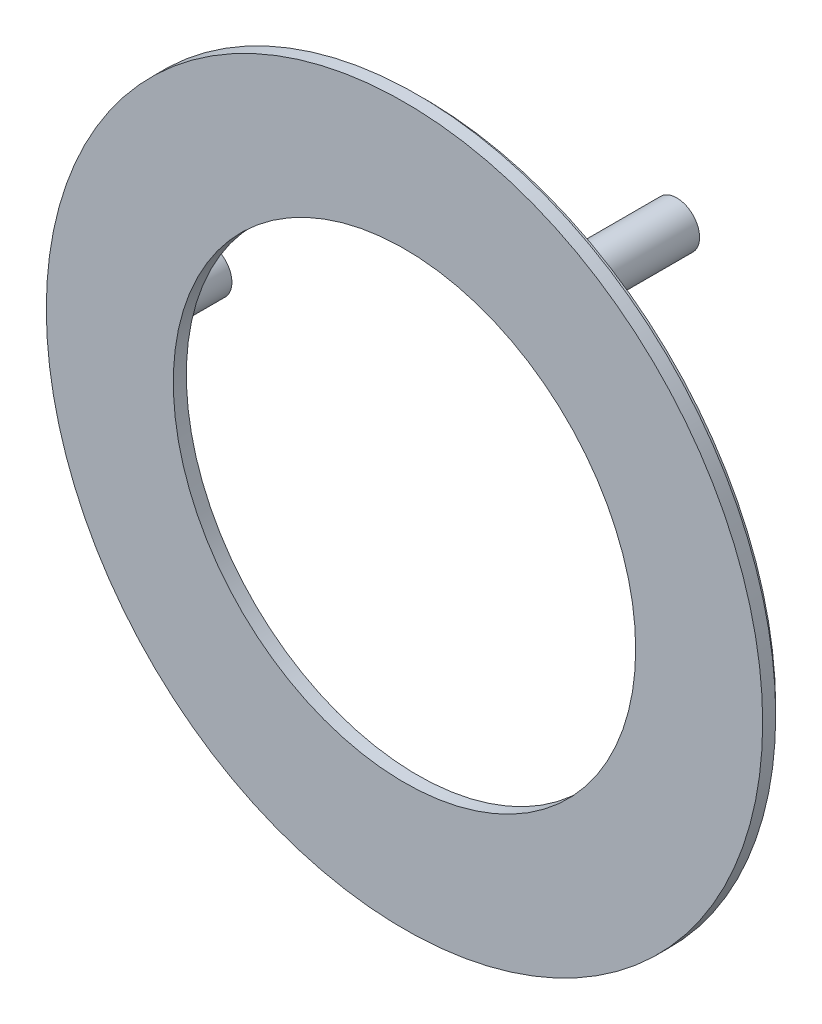
ISO-10303-21;
HEADER;
FILE_DESCRIPTION(('STEP AP214'),'2;1');
FILE_NAME('part.step','',(''),(''),'','','');
FILE_SCHEMA(('AUTOMOTIVE_DESIGN { 1 0 10303 214 1 1 1 1 }'));
ENDSEC;
DATA;
#1=APPLICATION_CONTEXT('core data for automotive mechanical design processes');
#2=APPLICATION_PROTOCOL_DEFINITION('international standard','automotive_design',2000,#1);
#3=PRODUCT_CONTEXT('',#1,'mechanical');
#4=PRODUCT('Part','Part','',(#3));
#5=PRODUCT_RELATED_PRODUCT_CATEGORY('part','',(#4));
#6=PRODUCT_DEFINITION_FORMATION('','',#4);
#7=PRODUCT_DEFINITION_CONTEXT('part definition',#1,'design');
#8=PRODUCT_DEFINITION('design','',#6,#7);
#9=PRODUCT_DEFINITION_SHAPE('','',#8);
#10=(LENGTH_UNIT() NAMED_UNIT(*) SI_UNIT(.MILLI.,.METRE.));
#11=(NAMED_UNIT(*) PLANE_ANGLE_UNIT() SI_UNIT($,.RADIAN.));
#12=(NAMED_UNIT(*) SI_UNIT($,.STERADIAN.) SOLID_ANGLE_UNIT());
#13=UNCERTAINTY_MEASURE_WITH_UNIT(LENGTH_MEASURE(1.E-05),#10,'distance_accuracy_value','');
#14=(GEOMETRIC_REPRESENTATION_CONTEXT(3) GLOBAL_UNCERTAINTY_ASSIGNED_CONTEXT((#13)) GLOBAL_UNIT_ASSIGNED_CONTEXT((#10,
#11,#12)) REPRESENTATION_CONTEXT('',''));
#15=CARTESIAN_POINT('',(0.,0.,0.));
#16=DIRECTION('',(0.,0.,1.));
#17=DIRECTION('',(1.,0.,0.));
#18=AXIS2_PLACEMENT_3D('',#15,#16,#17);
#19=CARTESIAN_POINT('',(0.,0.,49.));
#20=DIRECTION('',(0.,0.,1.));
#21=DIRECTION('',(1.,0.,0.));
#22=AXIS2_PLACEMENT_3D('',#19,#20,#21);
#23=CYLINDRICAL_SURFACE('',#22,54.);
#24=CARTESIAN_POINT('',(0.,0.,49.));
#25=DIRECTION('',(0.,0.,1.));
#26=DIRECTION('',(1.,0.,0.));
#27=AXIS2_PLACEMENT_3D('',#24,#25,#26);
#28=CIRCLE('',#27,54.);
#29=CARTESIAN_POINT('',(54.,0.,49.));
#30=VERTEX_POINT('',#29);
#31=EDGE_CURVE('E53',#30,#30,#28,.T.);
#32=ORIENTED_EDGE('',*,*,#31,.T.);
#33=EDGE_LOOP('',(#32));
#34=FACE_BOUND('',#33,.T.);
#35=CARTESIAN_POINT('',(0.,0.,50.));
#36=DIRECTION('',(0.,0.,1.));
#37=DIRECTION('',(1.,0.,0.));
#38=AXIS2_PLACEMENT_3D('',#35,#36,#37);
#39=CIRCLE('',#38,54.);
#40=CARTESIAN_POINT('',(54.,0.,50.));
#41=VERTEX_POINT('',#40);
#42=EDGE_CURVE('E56',#41,#41,#39,.T.);
#43=ORIENTED_EDGE('',*,*,#42,.F.);
#44=EDGE_LOOP('',(#43));
#45=FACE_BOUND('',#44,.T.);
#46=ADVANCED_FACE('F39',(#34,#45),#23,.T.);
#47=CARTESIAN_POINT('',(0.,0.,49.));
#48=DIRECTION('',(0.,0.,1.));
#49=DIRECTION('',(1.,0.,0.));
#50=AXIS2_PLACEMENT_3D('',#47,#48,#49);
#51=PLANE('',#50);
#52=CARTESIAN_POINT('',(0.,0.,49.));
#53=DIRECTION('',(0.,0.,1.));
#54=DIRECTION('',(1.,0.,0.));
#55=AXIS2_PLACEMENT_3D('',#52,#53,#54);
#56=CIRCLE('',#55,52.);
#57=CARTESIAN_POINT('',(52.,0.,49.));
#58=VERTEX_POINT('',#57);
#59=EDGE_CURVE('E59',#58,#58,#56,.T.);
#60=ORIENTED_EDGE('',*,*,#59,.T.);
#61=EDGE_LOOP('',(#60));
#62=FACE_BOUND('',#61,.T.);
#63=ORIENTED_EDGE('',*,*,#31,.F.);
#64=EDGE_LOOP('',(#63));
#65=FACE_BOUND('',#64,.T.);
#66=ADVANCED_FACE('F135',(#62,#65),#51,.F.);
#67=CARTESIAN_POINT('',(0.,0.,49.));
#68=DIRECTION('',(0.,0.,1.));
#69=DIRECTION('',(1.,0.,0.));
#70=AXIS2_PLACEMENT_3D('',#67,#68,#69);
#71=CYLINDRICAL_SURFACE('',#70,52.);
#72=ORIENTED_EDGE('',*,*,#59,.F.);
#73=EDGE_LOOP('',(#72));
#74=FACE_BOUND('',#73,.T.);
#75=CARTESIAN_POINT('',(0.,0.,50.));
#76=DIRECTION('',(0.,0.,1.));
#77=DIRECTION('',(1.,0.,0.));
#78=AXIS2_PLACEMENT_3D('',#75,#76,#77);
#79=CIRCLE('',#78,52.);
#80=CARTESIAN_POINT('',(52.,0.,50.));
#81=VERTEX_POINT('',#80);
#82=EDGE_CURVE('E62',#81,#81,#79,.T.);
#83=ORIENTED_EDGE('',*,*,#82,.T.);
#84=EDGE_LOOP('',(#83));
#85=FACE_BOUND('',#84,.T.);
#86=ADVANCED_FACE('F122',(#74,#85),#71,.F.);
#87=CARTESIAN_POINT('',(0.,0.,50.));
#88=DIRECTION('',(0.,0.,1.));
#89=DIRECTION('',(1.,0.,0.));
#90=AXIS2_PLACEMENT_3D('',#87,#88,#89);
#91=PLANE('',#90);
#92=CARTESIAN_POINT('',(24.1858412210151,-41.4613685788572,50.));
#93=DIRECTION('',(0.,0.,1.));
#94=DIRECTION('',(1.,0.,0.));
#95=AXIS2_PLACEMENT_3D('',#92,#93,#94);
#96=CIRCLE('',#95,3.5);
#97=CARTESIAN_POINT('',(27.6858412210151,-41.4613685788572,50.));
#98=VERTEX_POINT('',#97);
#99=EDGE_CURVE('E101',#98,#98,#96,.T.);
#100=ORIENTED_EDGE('',*,*,#99,.T.);
#101=EDGE_LOOP('',(#100));
#102=FACE_BOUND('',#101,.T.);
#103=CARTESIAN_POINT('',(23.8136778544525,41.6762371987246,50.));
#104=DIRECTION('',(0.,0.,1.));
#105=DIRECTION('',(1.,0.,0.));
#106=AXIS2_PLACEMENT_3D('',#103,#104,#105);
#107=CIRCLE('',#106,3.5);
#108=CARTESIAN_POINT('',(27.3136778544525,41.6762371987246,50.));
#109=VERTEX_POINT('',#108);
#110=EDGE_CURVE('E92',#109,#109,#107,.T.);
#111=ORIENTED_EDGE('',*,*,#110,.T.);
#112=EDGE_LOOP('',(#111));
#113=FACE_BOUND('',#112,.T.);
#114=CARTESIAN_POINT('',(-47.9995190754678,-0.214868619867746,50.));
#115=DIRECTION('',(0.,0.,1.));
#116=DIRECTION('',(1.,0.,0.));
#117=AXIS2_PLACEMENT_3D('',#114,#115,#116);
#118=CIRCLE('',#117,3.5);
#119=CARTESIAN_POINT('',(-44.4995190754678,-0.214868619867746,50.));
#120=VERTEX_POINT('',#119);
#121=EDGE_CURVE('E83',#120,#120,#118,.T.);
#122=ORIENTED_EDGE('',*,*,#121,.T.);
#123=EDGE_LOOP('',(#122));
#124=FACE_BOUND('',#123,.T.);
#125=CARTESIAN_POINT('',(0.,0.,50.));
#126=DIRECTION('',(0.,0.,1.));
#127=DIRECTION('',(1.,0.,0.));
#128=AXIS2_PLACEMENT_3D('',#125,#126,#127);
#129=CIRCLE('',#128,35.5);
#130=CARTESIAN_POINT('',(35.5,0.,50.));
#131=VERTEX_POINT('',#130);
#132=EDGE_CURVE('E74',#131,#131,#129,.T.);
#133=ORIENTED_EDGE('',*,*,#132,.T.);
#134=EDGE_LOOP('',(#133));
#135=FACE_BOUND('',#134,.T.);
#136=ORIENTED_EDGE('',*,*,#82,.F.);
#137=EDGE_LOOP('',(#136));
#138=FACE_BOUND('',#137,.T.);
#139=ADVANCED_FACE('F118',(#102,#113,#124,#135,#138),#91,.F.);
#140=CARTESIAN_POINT('',(0.,0.,52.));
#141=DIRECTION('',(0.,0.,1.));
#142=DIRECTION('',(1.,0.,0.));
#143=AXIS2_PLACEMENT_3D('',#140,#141,#142);
#144=PLANE('',#143);
#145=CARTESIAN_POINT('',(0.,0.,52.));
#146=DIRECTION('',(0.,0.,1.));
#147=DIRECTION('',(1.,0.,0.));
#148=AXIS2_PLACEMENT_3D('',#145,#146,#147);
#149=CIRCLE('',#148,55.);
#150=CARTESIAN_POINT('',(55.,0.,52.));
#151=VERTEX_POINT('',#150);
#152=EDGE_CURVE('E65',#151,#151,#149,.T.);
#153=ORIENTED_EDGE('',*,*,#152,.T.);
#154=EDGE_LOOP('',(#153));
#155=FACE_BOUND('',#154,.T.);
#156=CARTESIAN_POINT('',(0.,0.,52.));
#157=DIRECTION('',(0.,0.,1.));
#158=DIRECTION('',(1.,0.,0.));
#159=AXIS2_PLACEMENT_3D('',#156,#157,#158);
#160=CIRCLE('',#159,35.5);
#161=CARTESIAN_POINT('',(35.5,0.,52.));
#162=VERTEX_POINT('',#161);
#163=EDGE_CURVE('E71',#162,#162,#160,.T.);
#164=ORIENTED_EDGE('',*,*,#163,.F.);
#165=EDGE_LOOP('',(#164));
#166=FACE_BOUND('',#165,.T.);
#167=ADVANCED_FACE('F121',(#155,#166),#144,.T.);
#168=ORIENTED_EDGE('',*,*,#42,.T.);
#169=EDGE_LOOP('',(#168));
#170=FACE_BOUND('',#169,.T.);
#171=CARTESIAN_POINT('',(0.,0.,50.));
#172=DIRECTION('',(0.,0.,1.));
#173=DIRECTION('',(1.,0.,0.));
#174=AXIS2_PLACEMENT_3D('',#171,#172,#173);
#175=CIRCLE('',#174,55.);
#176=CARTESIAN_POINT('',(55.,0.,50.));
#177=VERTEX_POINT('',#176);
#178=EDGE_CURVE('E68',#177,#177,#175,.T.);
#179=ORIENTED_EDGE('',*,*,#178,.F.);
#180=EDGE_LOOP('',(#179));
#181=FACE_BOUND('',#180,.T.);
#182=ADVANCED_FACE('F124',(#170,#181),#91,.F.);
#183=CARTESIAN_POINT('',(0.,0.,52.));
#184=DIRECTION('',(0.,0.,-1.));
#185=DIRECTION('',(-1.,0.,0.));
#186=AXIS2_PLACEMENT_3D('',#183,#184,#185);
#187=CYLINDRICAL_SURFACE('',#186,55.);
#188=ORIENTED_EDGE('',*,*,#152,.F.);
#189=EDGE_LOOP('',(#188));
#190=FACE_BOUND('',#189,.T.);
#191=ORIENTED_EDGE('',*,*,#178,.T.);
#192=EDGE_LOOP('',(#191));
#193=FACE_BOUND('',#192,.T.);
#194=ADVANCED_FACE('F156',(#190,#193),#187,.T.);
#195=CARTESIAN_POINT('',(0.,0.,52.));
#196=DIRECTION('',(0.,0.,-1.));
#197=DIRECTION('',(-1.,0.,0.));
#198=AXIS2_PLACEMENT_3D('',#195,#196,#197);
#199=CYLINDRICAL_SURFACE('',#198,35.5);
#200=ORIENTED_EDGE('',*,*,#163,.T.);
#201=EDGE_LOOP('',(#200));
#202=FACE_BOUND('',#201,.T.);
#203=ORIENTED_EDGE('',*,*,#132,.F.);
#204=EDGE_LOOP('',(#203));
#205=FACE_BOUND('',#204,.T.);
#206=ADVANCED_FACE('F161',(#202,#205),#199,.F.);
#207=CARTESIAN_POINT('',(-47.9995190754678,-0.214868619867746,24.1005050633883));
#208=DIRECTION('',(0.,0.,1.));
#209=DIRECTION('',(1.,0.,0.));
#210=AXIS2_PLACEMENT_3D('',#207,#208,#209);
#211=CYLINDRICAL_SURFACE('',#210,3.5);
#212=CARTESIAN_POINT('',(-47.9995190754678,-0.214868619867746,34.));
#213=DIRECTION('',(0.,0.,1.));
#214=DIRECTION('',(1.,0.,0.));
#215=AXIS2_PLACEMENT_3D('',#212,#213,#214);
#216=CIRCLE('',#215,3.5);
#217=CARTESIAN_POINT('',(-44.4995190754678,-0.214868619867746,34.));
#218=VERTEX_POINT('',#217);
#219=EDGE_CURVE('E82',#218,#218,#216,.F.);
#220=ORIENTED_EDGE('',*,*,#219,.F.);
#221=EDGE_LOOP('',(#220));
#222=FACE_BOUND('',#221,.T.);
#223=ORIENTED_EDGE('',*,*,#121,.F.);
#224=EDGE_LOOP('',(#223));
#225=FACE_BOUND('',#224,.T.);
#226=ADVANCED_FACE('F167',(#222,#225),#211,.T.);
#227=CARTESIAN_POINT('',(-47.9995190754678,-0.214868619867745,24.1005050633883));
#228=DIRECTION('',(0.,0.,1.));
#229=DIRECTION('',(1.,0.,0.));
#230=AXIS2_PLACEMENT_3D('',#227,#228,#229);
#231=CYLINDRICAL_SURFACE('',#230,2.);
#232=CARTESIAN_POINT('',(-47.9995190754678,-0.214868619867745,34.));
#233=DIRECTION('',(0.,0.,1.));
#234=DIRECTION('',(1.,0.,0.));
#235=AXIS2_PLACEMENT_3D('',#232,#233,#234);
#236=CIRCLE('',#235,2.);
#237=CARTESIAN_POINT('',(-45.9995190754678,-0.214868619867745,34.));
#238=VERTEX_POINT('',#237);
#239=EDGE_CURVE('E77',#238,#238,#236,.F.);
#240=ORIENTED_EDGE('',*,*,#239,.T.);
#241=EDGE_LOOP('',(#240));
#242=FACE_BOUND('',#241,.T.);
#243=CARTESIAN_POINT('',(-47.9995190754678,-0.214868619867745,50.));
#244=DIRECTION('',(0.,0.,1.));
#245=DIRECTION('',(1.,0.,0.));
#246=AXIS2_PLACEMENT_3D('',#243,#244,#245);
#247=CIRCLE('',#246,2.);
#248=CARTESIAN_POINT('',(-45.9995190754678,-0.214868619867745,50.));
#249=VERTEX_POINT('',#248);
#250=EDGE_CURVE('E49',#249,#249,#247,.T.);
#251=ORIENTED_EDGE('',*,*,#250,.T.);
#252=EDGE_LOOP('',(#251));
#253=FACE_BOUND('',#252,.T.);
#254=ADVANCED_FACE('F177',(#242,#253),#231,.F.);
#255=CARTESIAN_POINT('',(0.,0.,34.));
#256=DIRECTION('',(0.,0.,1.));
#257=DIRECTION('',(1.,0.,0.));
#258=AXIS2_PLACEMENT_3D('',#255,#256,#257);
#259=PLANE('',#258);
#260=ORIENTED_EDGE('',*,*,#219,.T.);
#261=EDGE_LOOP('',(#260));
#262=FACE_BOUND('',#261,.T.);
#263=ORIENTED_EDGE('',*,*,#239,.F.);
#264=EDGE_LOOP('',(#263));
#265=FACE_BOUND('',#264,.T.);
#266=ADVANCED_FACE('F181',(#262,#265),#259,.F.);
#267=ORIENTED_EDGE('',*,*,#250,.F.);
#268=EDGE_LOOP('',(#267));
#269=FACE_BOUND('',#268,.T.);
#270=ADVANCED_FACE('F125',(#269),#91,.F.);
#271=CARTESIAN_POINT('',(23.8136778544525,41.6762371987246,24.1005050633883));
#272=DIRECTION('',(0.,0.,1.));
#273=DIRECTION('',(1.,0.,0.));
#274=AXIS2_PLACEMENT_3D('',#271,#272,#273);
#275=CYLINDRICAL_SURFACE('',#274,3.5);
#276=CARTESIAN_POINT('',(23.8136778544525,41.6762371987246,34.));
#277=DIRECTION('',(0.,0.,1.));
#278=DIRECTION('',(1.,0.,0.));
#279=AXIS2_PLACEMENT_3D('',#276,#277,#278);
#280=CIRCLE('',#279,3.5);
#281=CARTESIAN_POINT('',(27.3136778544525,41.6762371987246,34.));
#282=VERTEX_POINT('',#281);
#283=EDGE_CURVE('E91',#282,#282,#280,.F.);
#284=ORIENTED_EDGE('',*,*,#283,.F.);
#285=EDGE_LOOP('',(#284));
#286=FACE_BOUND('',#285,.T.);
#287=ORIENTED_EDGE('',*,*,#110,.F.);
#288=EDGE_LOOP('',(#287));
#289=FACE_BOUND('',#288,.T.);
#290=ADVANCED_FACE('F186',(#286,#289),#275,.T.);
#291=CARTESIAN_POINT('',(23.8136778544525,41.6762371987246,24.1005050633883));
#292=DIRECTION('',(0.,0.,1.));
#293=DIRECTION('',(1.,0.,0.));
#294=AXIS2_PLACEMENT_3D('',#291,#292,#293);
#295=CYLINDRICAL_SURFACE('',#294,2.);
#296=CARTESIAN_POINT('',(23.8136778544525,41.6762371987246,34.));
#297=DIRECTION('',(0.,0.,1.));
#298=DIRECTION('',(1.,0.,0.));
#299=AXIS2_PLACEMENT_3D('',#296,#297,#298);
#300=CIRCLE('',#299,2.);
#301=CARTESIAN_POINT('',(25.8136778544525,41.6762371987246,34.));
#302=VERTEX_POINT('',#301);
#303=EDGE_CURVE('E86',#302,#302,#300,.F.);
#304=ORIENTED_EDGE('',*,*,#303,.T.);
#305=EDGE_LOOP('',(#304));
#306=FACE_BOUND('',#305,.T.);
#307=CARTESIAN_POINT('',(23.8136778544525,41.6762371987246,50.));
#308=DIRECTION('',(0.,0.,1.));
#309=DIRECTION('',(1.,0.,0.));
#310=AXIS2_PLACEMENT_3D('',#307,#308,#309);
#311=CIRCLE('',#310,2.);
#312=CARTESIAN_POINT('',(25.8136778544525,41.6762371987246,50.));
#313=VERTEX_POINT('',#312);
#314=EDGE_CURVE('E45',#313,#313,#311,.T.);
#315=ORIENTED_EDGE('',*,*,#314,.T.);
#316=EDGE_LOOP('',(#315));
#317=FACE_BOUND('',#316,.T.);
#318=ADVANCED_FACE('F189',(#306,#317),#295,.F.);
#319=CARTESIAN_POINT('',(0.,0.,34.));
#320=DIRECTION('',(0.,0.,1.));
#321=DIRECTION('',(1.,0.,0.));
#322=AXIS2_PLACEMENT_3D('',#319,#320,#321);
#323=PLANE('',#322);
#324=ORIENTED_EDGE('',*,*,#283,.T.);
#325=EDGE_LOOP('',(#324));
#326=FACE_BOUND('',#325,.T.);
#327=ORIENTED_EDGE('',*,*,#303,.F.);
#328=EDGE_LOOP('',(#327));
#329=FACE_BOUND('',#328,.T.);
#330=ADVANCED_FACE('F193',(#326,#329),#323,.F.);
#331=ORIENTED_EDGE('',*,*,#314,.F.);
#332=EDGE_LOOP('',(#331));
#333=FACE_BOUND('',#332,.T.);
#334=ADVANCED_FACE('F114',(#333),#91,.F.);
#335=CARTESIAN_POINT('',(24.1858412210151,-41.4613685788572,24.1005050633883));
#336=DIRECTION('',(0.,0.,1.));
#337=DIRECTION('',(1.,0.,0.));
#338=AXIS2_PLACEMENT_3D('',#335,#336,#337);
#339=CYLINDRICAL_SURFACE('',#338,3.5);
#340=CARTESIAN_POINT('',(24.1858412210151,-41.4613685788572,34.));
#341=DIRECTION('',(0.,0.,1.));
#342=DIRECTION('',(1.,0.,0.));
#343=AXIS2_PLACEMENT_3D('',#340,#341,#342);
#344=CIRCLE('',#343,3.5);
#345=CARTESIAN_POINT('',(27.6858412210151,-41.4613685788572,34.));
#346=VERTEX_POINT('',#345);
#347=EDGE_CURVE('E100',#346,#346,#344,.F.);
#348=ORIENTED_EDGE('',*,*,#347,.F.);
#349=EDGE_LOOP('',(#348));
#350=FACE_BOUND('',#349,.T.);
#351=ORIENTED_EDGE('',*,*,#99,.F.);
#352=EDGE_LOOP('',(#351));
#353=FACE_BOUND('',#352,.T.);
#354=ADVANCED_FACE('F110',(#350,#353),#339,.T.);
#355=CARTESIAN_POINT('',(24.1858412210151,-41.4613685788572,24.1005050633883));
#356=DIRECTION('',(0.,0.,1.));
#357=DIRECTION('',(1.,0.,0.));
#358=AXIS2_PLACEMENT_3D('',#355,#356,#357);
#359=CYLINDRICAL_SURFACE('',#358,2.);
#360=CARTESIAN_POINT('',(24.1858412210151,-41.4613685788572,34.));
#361=DIRECTION('',(0.,0.,1.));
#362=DIRECTION('',(1.,0.,0.));
#363=AXIS2_PLACEMENT_3D('',#360,#361,#362);
#364=CIRCLE('',#363,2.);
#365=CARTESIAN_POINT('',(26.1858412210151,-41.4613685788572,34.));
#366=VERTEX_POINT('',#365);
#367=EDGE_CURVE('E95',#366,#366,#364,.F.);
#368=ORIENTED_EDGE('',*,*,#367,.T.);
#369=EDGE_LOOP('',(#368));
#370=FACE_BOUND('',#369,.T.);
#371=CARTESIAN_POINT('',(24.1858412210151,-41.4613685788572,50.));
#372=DIRECTION('',(0.,0.,1.));
#373=DIRECTION('',(1.,0.,0.));
#374=AXIS2_PLACEMENT_3D('',#371,#372,#373);
#375=CIRCLE('',#374,2.);
#376=CARTESIAN_POINT('',(26.1858412210151,-41.4613685788572,50.));
#377=VERTEX_POINT('',#376);
#378=EDGE_CURVE('E10',#377,#377,#375,.T.);
#379=ORIENTED_EDGE('',*,*,#378,.T.);
#380=EDGE_LOOP('',(#379));
#381=FACE_BOUND('',#380,.T.);
#382=ADVANCED_FACE('F113',(#370,#381),#359,.F.);
#383=CARTESIAN_POINT('',(0.,0.,34.));
#384=DIRECTION('',(0.,0.,1.));
#385=DIRECTION('',(1.,0.,0.));
#386=AXIS2_PLACEMENT_3D('',#383,#384,#385);
#387=PLANE('',#386);
#388=ORIENTED_EDGE('',*,*,#347,.T.);
#389=EDGE_LOOP('',(#388));
#390=FACE_BOUND('',#389,.T.);
#391=ORIENTED_EDGE('',*,*,#367,.F.);
#392=EDGE_LOOP('',(#391));
#393=FACE_BOUND('',#392,.T.);
#394=ADVANCED_FACE('F107',(#390,#393),#387,.F.);
#395=ORIENTED_EDGE('',*,*,#378,.F.);
#396=EDGE_LOOP('',(#395));
#397=FACE_BOUND('',#396,.T.);
#398=ADVANCED_FACE('F157',(#397),#91,.F.);
#399=CLOSED_SHELL('',(#46,#66,#86,#139,#167,#182,#194,#206,#226,#254,#266,#270,#290,#318,#330,
#334,#354,#382,#394,#398));
#400=MANIFOLD_SOLID_BREP('B2',#399);
#401=ADVANCED_BREP_SHAPE_REPRESENTATION('',(#18,#400),#14);
#402=SHAPE_DEFINITION_REPRESENTATION(#9,#401);
ENDSEC;
END-ISO-10303-21;
